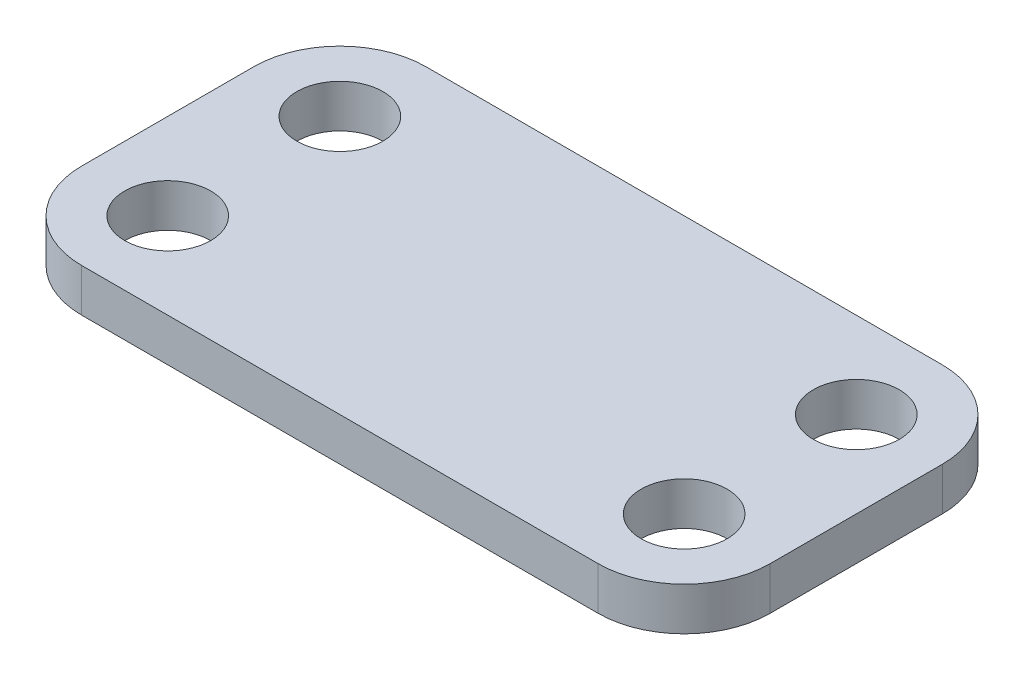
ISO-10303-21;
HEADER;
FILE_DESCRIPTION(('STEP AP214'),'2;1');
FILE_NAME('part.step','',(''),(''),'','','');
FILE_SCHEMA(('AUTOMOTIVE_DESIGN { 1 0 10303 214 1 1 1 1 }'));
ENDSEC;
DATA;
#1=APPLICATION_CONTEXT('core data for automotive mechanical design processes');
#2=APPLICATION_PROTOCOL_DEFINITION('international standard','automotive_design',2000,#1);
#3=PRODUCT_CONTEXT('',#1,'mechanical');
#4=PRODUCT('Part','Part','',(#3));
#5=PRODUCT_RELATED_PRODUCT_CATEGORY('part','',(#4));
#6=PRODUCT_DEFINITION_FORMATION('','',#4);
#7=PRODUCT_DEFINITION_CONTEXT('part definition',#1,'design');
#8=PRODUCT_DEFINITION('design','',#6,#7);
#9=PRODUCT_DEFINITION_SHAPE('','',#8);
#10=(LENGTH_UNIT() NAMED_UNIT(*) SI_UNIT(.MILLI.,.METRE.));
#11=(NAMED_UNIT(*) PLANE_ANGLE_UNIT() SI_UNIT($,.RADIAN.));
#12=(NAMED_UNIT(*) SI_UNIT($,.STERADIAN.) SOLID_ANGLE_UNIT());
#13=UNCERTAINTY_MEASURE_WITH_UNIT(LENGTH_MEASURE(1.E-05),#10,'distance_accuracy_value','');
#14=(GEOMETRIC_REPRESENTATION_CONTEXT(3) GLOBAL_UNCERTAINTY_ASSIGNED_CONTEXT((#13)) GLOBAL_UNIT_ASSIGNED_CONTEXT((#10,
#11,#12)) REPRESENTATION_CONTEXT('',''));
#15=CARTESIAN_POINT('',(0.,0.,0.));
#16=DIRECTION('',(0.,0.,1.));
#17=DIRECTION('',(1.,0.,0.));
#18=AXIS2_PLACEMENT_3D('',#15,#16,#17);
#19=CARTESIAN_POINT('',(-19.05,3.175,6.35));
#20=DIRECTION('',(0.,-1.,0.));
#21=DIRECTION('',(0.,0.,-1.));
#22=AXIS2_PLACEMENT_3D('',#19,#20,#21);
#23=PLANE('',#22);
#24=CARTESIAN_POINT('',(-19.05,3.175,6.35));
#25=DIRECTION('',(0.,1.,0.));
#26=DIRECTION('',(0.,0.,-1.));
#27=AXIS2_PLACEMENT_3D('',#24,#25,#26);
#28=CIRCLE('',#27,6.35);
#29=CARTESIAN_POINT('',(-25.4,3.175,6.35));
#30=VERTEX_POINT('',#29);
#31=CARTESIAN_POINT('',(-19.05,3.175,12.7));
#32=VERTEX_POINT('',#31);
#33=EDGE_CURVE('E172',#30,#32,#28,.T.);
#34=ORIENTED_EDGE('',*,*,#33,.T.);
#35=DIRECTION('',(1.,0.,0.));
#36=VECTOR('',#35,1.);
#37=CARTESIAN_POINT('',(-19.05,3.175,12.7));
#38=LINE('',#37,#36);
#39=CARTESIAN_POINT('',(19.05,3.175,12.7));
#40=VERTEX_POINT('',#39);
#41=EDGE_CURVE('E106',#32,#40,#38,.T.);
#42=ORIENTED_EDGE('',*,*,#41,.T.);
#43=CARTESIAN_POINT('',(19.05,3.175,6.35));
#44=DIRECTION('',(0.,1.,0.));
#45=DIRECTION('',(0.,0.,1.));
#46=AXIS2_PLACEMENT_3D('',#43,#44,#45);
#47=CIRCLE('',#46,6.35);
#48=CARTESIAN_POINT('',(25.4,3.175,6.35));
#49=VERTEX_POINT('',#48);
#50=EDGE_CURVE('E195',#40,#49,#47,.T.);
#51=ORIENTED_EDGE('',*,*,#50,.T.);
#52=DIRECTION('',(0.,0.,-1.));
#53=VECTOR('',#52,1.);
#54=CARTESIAN_POINT('',(25.4,3.175,6.35));
#55=LINE('',#54,#53);
#56=CARTESIAN_POINT('',(25.4,3.175,-6.35));
#57=VERTEX_POINT('',#56);
#58=EDGE_CURVE('E209',#49,#57,#55,.T.);
#59=ORIENTED_EDGE('',*,*,#58,.T.);
#60=CARTESIAN_POINT('',(19.05,3.175,-6.35));
#61=DIRECTION('',(0.,1.,0.));
#62=DIRECTION('',(0.,0.,1.));
#63=AXIS2_PLACEMENT_3D('',#60,#61,#62);
#64=CIRCLE('',#63,6.35);
#65=CARTESIAN_POINT('',(19.05,3.175,-12.7));
#66=VERTEX_POINT('',#65);
#67=EDGE_CURVE('E125',#57,#66,#64,.T.);
#68=ORIENTED_EDGE('',*,*,#67,.T.);
#69=DIRECTION('',(-1.,0.,0.));
#70=VECTOR('',#69,1.);
#71=CARTESIAN_POINT('',(-19.05,3.175,-12.7));
#72=LINE('',#71,#70);
#73=CARTESIAN_POINT('',(-19.05,3.175,-12.7));
#74=VERTEX_POINT('',#73);
#75=EDGE_CURVE('E119',#66,#74,#72,.T.);
#76=ORIENTED_EDGE('',*,*,#75,.T.);
#77=CARTESIAN_POINT('',(-19.05,3.175,-6.34999999999999));
#78=DIRECTION('',(0.,1.,0.));
#79=DIRECTION('',(0.,0.,-1.));
#80=AXIS2_PLACEMENT_3D('',#77,#78,#79);
#81=CIRCLE('',#80,6.35);
#82=CARTESIAN_POINT('',(-25.4,3.175,-6.34999999999999));
#83=VERTEX_POINT('',#82);
#84=EDGE_CURVE('E123',#74,#83,#81,.T.);
#85=ORIENTED_EDGE('',*,*,#84,.T.);
#86=DIRECTION('',(0.,0.,1.));
#87=VECTOR('',#86,1.);
#88=CARTESIAN_POINT('',(-25.4,3.175,6.35));
#89=LINE('',#88,#87);
#90=EDGE_CURVE('E63',#83,#30,#89,.T.);
#91=ORIENTED_EDGE('',*,*,#90,.T.);
#92=EDGE_LOOP('',(#34,#42,#51,#59,#68,#76,#85,#91));
#93=FACE_BOUND('',#92,.T.);
#94=CARTESIAN_POINT('',(-19.05,3.175,-6.34999999999999));
#95=DIRECTION('',(0.,1.,0.));
#96=DIRECTION('',(0.,0.,1.));
#97=AXIS2_PLACEMENT_3D('',#94,#95,#96);
#98=CIRCLE('',#97,3.175);
#99=CARTESIAN_POINT('',(-19.05,3.175,-3.17499999999999));
#100=VERTEX_POINT('',#99);
#101=EDGE_CURVE('E154',#100,#100,#98,.T.);
#102=ORIENTED_EDGE('',*,*,#101,.F.);
#103=EDGE_LOOP('',(#102));
#104=FACE_BOUND('',#103,.T.);
#105=CARTESIAN_POINT('',(-19.05,3.175,6.35));
#106=DIRECTION('',(0.,1.,0.));
#107=DIRECTION('',(0.,0.,1.));
#108=AXIS2_PLACEMENT_3D('',#105,#106,#107);
#109=CIRCLE('',#108,3.175);
#110=CARTESIAN_POINT('',(-19.05,3.175,9.525));
#111=VERTEX_POINT('',#110);
#112=EDGE_CURVE('E225',#111,#111,#109,.T.);
#113=ORIENTED_EDGE('',*,*,#112,.F.);
#114=EDGE_LOOP('',(#113));
#115=FACE_BOUND('',#114,.T.);
#116=CARTESIAN_POINT('',(19.05,3.175,-6.35));
#117=DIRECTION('',(0.,1.,0.));
#118=DIRECTION('',(0.,0.,1.));
#119=AXIS2_PLACEMENT_3D('',#116,#117,#118);
#120=CIRCLE('',#119,3.175);
#121=CARTESIAN_POINT('',(19.05,3.175,-3.175));
#122=VERTEX_POINT('',#121);
#123=EDGE_CURVE('E233',#122,#122,#120,.T.);
#124=ORIENTED_EDGE('',*,*,#123,.F.);
#125=EDGE_LOOP('',(#124));
#126=FACE_BOUND('',#125,.T.);
#127=CARTESIAN_POINT('',(19.05,3.175,6.35));
#128=DIRECTION('',(0.,1.,0.));
#129=DIRECTION('',(0.,0.,1.));
#130=AXIS2_PLACEMENT_3D('',#127,#128,#129);
#131=CIRCLE('',#130,3.175);
#132=CARTESIAN_POINT('',(19.05,3.175,9.52499999999999));
#133=VERTEX_POINT('',#132);
#134=EDGE_CURVE('E241',#133,#133,#131,.T.);
#135=ORIENTED_EDGE('',*,*,#134,.F.);
#136=EDGE_LOOP('',(#135));
#137=FACE_BOUND('',#136,.T.);
#138=ADVANCED_FACE('F45',(#93,#104,#115,#126,#137),#23,.F.);
#139=CARTESIAN_POINT('',(-19.05,0.,6.35));
#140=DIRECTION('',(0.,-1.,0.));
#141=DIRECTION('',(0.,0.,-1.));
#142=AXIS2_PLACEMENT_3D('',#139,#140,#141);
#143=PLANE('',#142);
#144=CARTESIAN_POINT('',(19.05,0.,-6.35));
#145=DIRECTION('',(0.,1.,0.));
#146=DIRECTION('',(0.,0.,1.));
#147=AXIS2_PLACEMENT_3D('',#144,#145,#146);
#148=CIRCLE('',#147,3.175);
#149=CARTESIAN_POINT('',(19.05,0.,-3.175));
#150=VERTEX_POINT('',#149);
#151=EDGE_CURVE('E237',#150,#150,#148,.T.);
#152=ORIENTED_EDGE('',*,*,#151,.T.);
#153=EDGE_LOOP('',(#152));
#154=FACE_BOUND('',#153,.T.);
#155=CARTESIAN_POINT('',(-19.05,0.,-6.34999999999999));
#156=DIRECTION('',(0.,1.,0.));
#157=DIRECTION('',(0.,0.,1.));
#158=AXIS2_PLACEMENT_3D('',#155,#156,#157);
#159=CIRCLE('',#158,3.175);
#160=CARTESIAN_POINT('',(-19.05,0.,-3.17499999999999));
#161=VERTEX_POINT('',#160);
#162=EDGE_CURVE('E221',#161,#161,#159,.T.);
#163=ORIENTED_EDGE('',*,*,#162,.T.);
#164=EDGE_LOOP('',(#163));
#165=FACE_BOUND('',#164,.T.);
#166=CARTESIAN_POINT('',(-19.05,0.,6.35));
#167=DIRECTION('',(0.,1.,0.));
#168=DIRECTION('',(0.,0.,-1.));
#169=AXIS2_PLACEMENT_3D('',#166,#167,#168);
#170=CIRCLE('',#169,6.35);
#171=CARTESIAN_POINT('',(-25.4,0.,6.35));
#172=VERTEX_POINT('',#171);
#173=CARTESIAN_POINT('',(-19.05,0.,12.7));
#174=VERTEX_POINT('',#173);
#175=EDGE_CURVE('E149',#172,#174,#170,.T.);
#176=ORIENTED_EDGE('',*,*,#175,.F.);
#177=DIRECTION('',(0.,0.,1.));
#178=VECTOR('',#177,1.);
#179=CARTESIAN_POINT('',(-25.4,0.,6.35));
#180=LINE('',#179,#178);
#181=CARTESIAN_POINT('',(-25.4,0.,-6.34999999999999));
#182=VERTEX_POINT('',#181);
#183=EDGE_CURVE('E98',#182,#172,#180,.T.);
#184=ORIENTED_EDGE('',*,*,#183,.F.);
#185=CARTESIAN_POINT('',(-19.05,0.,-6.34999999999999));
#186=DIRECTION('',(0.,1.,0.));
#187=DIRECTION('',(0.,0.,-1.));
#188=AXIS2_PLACEMENT_3D('',#185,#186,#187);
#189=CIRCLE('',#188,6.35);
#190=CARTESIAN_POINT('',(-19.05,0.,-12.7));
#191=VERTEX_POINT('',#190);
#192=EDGE_CURVE('E92',#191,#182,#189,.T.);
#193=ORIENTED_EDGE('',*,*,#192,.F.);
#194=DIRECTION('',(-1.,0.,0.));
#195=VECTOR('',#194,1.);
#196=CARTESIAN_POINT('',(-19.05,0.,-12.7));
#197=LINE('',#196,#195);
#198=CARTESIAN_POINT('',(19.05,0.,-12.7));
#199=VERTEX_POINT('',#198);
#200=EDGE_CURVE('E134',#199,#191,#197,.T.);
#201=ORIENTED_EDGE('',*,*,#200,.F.);
#202=CARTESIAN_POINT('',(19.05,0.,-6.35));
#203=DIRECTION('',(0.,1.,0.));
#204=DIRECTION('',(0.,0.,1.));
#205=AXIS2_PLACEMENT_3D('',#202,#203,#204);
#206=CIRCLE('',#205,6.35);
#207=CARTESIAN_POINT('',(25.4,0.,-6.35));
#208=VERTEX_POINT('',#207);
#209=EDGE_CURVE('E163',#208,#199,#206,.T.);
#210=ORIENTED_EDGE('',*,*,#209,.F.);
#211=DIRECTION('',(0.,0.,-1.));
#212=VECTOR('',#211,1.);
#213=CARTESIAN_POINT('',(25.4,0.,6.35));
#214=LINE('',#213,#212);
#215=CARTESIAN_POINT('',(25.4,0.,6.35));
#216=VERTEX_POINT('',#215);
#217=EDGE_CURVE('E160',#216,#208,#214,.T.);
#218=ORIENTED_EDGE('',*,*,#217,.F.);
#219=CARTESIAN_POINT('',(19.05,0.,6.35));
#220=DIRECTION('',(0.,1.,0.));
#221=DIRECTION('',(0.,0.,1.));
#222=AXIS2_PLACEMENT_3D('',#219,#220,#221);
#223=CIRCLE('',#222,6.35);
#224=CARTESIAN_POINT('',(19.05,0.,12.7));
#225=VERTEX_POINT('',#224);
#226=EDGE_CURVE('E157',#225,#216,#223,.T.);
#227=ORIENTED_EDGE('',*,*,#226,.F.);
#228=DIRECTION('',(1.,0.,0.));
#229=VECTOR('',#228,1.);
#230=CARTESIAN_POINT('',(-19.05,0.,12.7));
#231=LINE('',#230,#229);
#232=EDGE_CURVE('E153',#174,#225,#231,.T.);
#233=ORIENTED_EDGE('',*,*,#232,.F.);
#234=EDGE_LOOP('',(#176,#184,#193,#201,#210,#218,#227,#233));
#235=FACE_BOUND('',#234,.T.);
#236=CARTESIAN_POINT('',(-19.05,0.,6.35));
#237=DIRECTION('',(0.,1.,0.));
#238=DIRECTION('',(0.,0.,1.));
#239=AXIS2_PLACEMENT_3D('',#236,#237,#238);
#240=CIRCLE('',#239,3.175);
#241=CARTESIAN_POINT('',(-19.05,0.,9.525));
#242=VERTEX_POINT('',#241);
#243=EDGE_CURVE('E229',#242,#242,#240,.T.);
#244=ORIENTED_EDGE('',*,*,#243,.T.);
#245=EDGE_LOOP('',(#244));
#246=FACE_BOUND('',#245,.T.);
#247=CARTESIAN_POINT('',(19.05,0.,6.35));
#248=DIRECTION('',(0.,1.,0.));
#249=DIRECTION('',(0.,0.,1.));
#250=AXIS2_PLACEMENT_3D('',#247,#248,#249);
#251=CIRCLE('',#250,3.175);
#252=CARTESIAN_POINT('',(19.05,0.,9.52499999999999));
#253=VERTEX_POINT('',#252);
#254=EDGE_CURVE('E245',#253,#253,#251,.T.);
#255=ORIENTED_EDGE('',*,*,#254,.T.);
#256=EDGE_LOOP('',(#255));
#257=FACE_BOUND('',#256,.T.);
#258=ADVANCED_FACE('F199',(#154,#165,#235,#246,#257),#143,.T.);
#259=CARTESIAN_POINT('',(-19.05,3.175,6.35));
#260=DIRECTION('',(0.,-1.,0.));
#261=DIRECTION('',(0.,0.,-1.));
#262=AXIS2_PLACEMENT_3D('',#259,#260,#261);
#263=CYLINDRICAL_SURFACE('',#262,6.35);
#264=ORIENTED_EDGE('',*,*,#175,.T.);
#265=DIRECTION('',(0.,-1.,0.));
#266=VECTOR('',#265,1.);
#267=CARTESIAN_POINT('',(-19.05,3.175,12.7));
#268=LINE('',#267,#266);
#269=EDGE_CURVE('E11',#32,#174,#268,.T.);
#270=ORIENTED_EDGE('',*,*,#269,.F.);
#271=ORIENTED_EDGE('',*,*,#33,.F.);
#272=DIRECTION('',(0.,-1.,0.));
#273=VECTOR('',#272,1.);
#274=CARTESIAN_POINT('',(-25.4,3.175,6.35));
#275=LINE('',#274,#273);
#276=EDGE_CURVE('E145',#30,#172,#275,.T.);
#277=ORIENTED_EDGE('',*,*,#276,.T.);
#278=EDGE_LOOP('',(#264,#270,#271,#277));
#279=FACE_BOUND('',#278,.T.);
#280=ADVANCED_FACE('F47',(#279),#263,.T.);
#281=CARTESIAN_POINT('',(-19.05,3.175,12.7));
#282=DIRECTION('',(0.,0.,-1.));
#283=DIRECTION('',(-1.,0.,0.));
#284=AXIS2_PLACEMENT_3D('',#281,#282,#283);
#285=PLANE('',#284);
#286=ORIENTED_EDGE('',*,*,#232,.T.);
#287=DIRECTION('',(0.,-1.,0.));
#288=VECTOR('',#287,1.);
#289=CARTESIAN_POINT('',(19.05,3.175,12.7));
#290=LINE('',#289,#288);
#291=EDGE_CURVE('E55',#40,#225,#290,.T.);
#292=ORIENTED_EDGE('',*,*,#291,.F.);
#293=ORIENTED_EDGE('',*,*,#41,.F.);
#294=ORIENTED_EDGE('',*,*,#269,.T.);
#295=EDGE_LOOP('',(#286,#292,#293,#294));
#296=FACE_BOUND('',#295,.T.);
#297=ADVANCED_FACE('F281',(#296),#285,.F.);
#298=CARTESIAN_POINT('',(19.05,3.175,6.35));
#299=DIRECTION('',(0.,-1.,0.));
#300=DIRECTION('',(0.,0.,-1.));
#301=AXIS2_PLACEMENT_3D('',#298,#299,#300);
#302=CYLINDRICAL_SURFACE('',#301,6.35);
#303=ORIENTED_EDGE('',*,*,#226,.T.);
#304=DIRECTION('',(0.,-1.,0.));
#305=VECTOR('',#304,1.);
#306=CARTESIAN_POINT('',(25.4,3.175,6.35));
#307=LINE('',#306,#305);
#308=EDGE_CURVE('E183',#49,#216,#307,.T.);
#309=ORIENTED_EDGE('',*,*,#308,.F.);
#310=ORIENTED_EDGE('',*,*,#50,.F.);
#311=ORIENTED_EDGE('',*,*,#291,.T.);
#312=EDGE_LOOP('',(#303,#309,#310,#311));
#313=FACE_BOUND('',#312,.T.);
#314=ADVANCED_FACE('F193',(#313),#302,.T.);
#315=CARTESIAN_POINT('',(25.4,3.175,6.35));
#316=DIRECTION('',(-1.,0.,0.));
#317=DIRECTION('',(0.,0.,1.));
#318=AXIS2_PLACEMENT_3D('',#315,#316,#317);
#319=PLANE('',#318);
#320=ORIENTED_EDGE('',*,*,#217,.T.);
#321=DIRECTION('',(0.,-1.,0.));
#322=VECTOR('',#321,1.);
#323=CARTESIAN_POINT('',(25.4,3.175,-6.35));
#324=LINE('',#323,#322);
#325=EDGE_CURVE('E179',#57,#208,#324,.T.);
#326=ORIENTED_EDGE('',*,*,#325,.F.);
#327=ORIENTED_EDGE('',*,*,#58,.F.);
#328=ORIENTED_EDGE('',*,*,#308,.T.);
#329=EDGE_LOOP('',(#320,#326,#327,#328));
#330=FACE_BOUND('',#329,.T.);
#331=ADVANCED_FACE('F204',(#330),#319,.F.);
#332=CARTESIAN_POINT('',(19.05,3.175,-6.35));
#333=DIRECTION('',(0.,-1.,0.));
#334=DIRECTION('',(0.,0.,-1.));
#335=AXIS2_PLACEMENT_3D('',#332,#333,#334);
#336=CYLINDRICAL_SURFACE('',#335,6.35);
#337=ORIENTED_EDGE('',*,*,#209,.T.);
#338=DIRECTION('',(0.,-1.,0.));
#339=VECTOR('',#338,1.);
#340=CARTESIAN_POINT('',(19.05,3.175,-12.7));
#341=LINE('',#340,#339);
#342=EDGE_CURVE('E136',#66,#199,#341,.T.);
#343=ORIENTED_EDGE('',*,*,#342,.F.);
#344=ORIENTED_EDGE('',*,*,#67,.F.);
#345=ORIENTED_EDGE('',*,*,#325,.T.);
#346=EDGE_LOOP('',(#337,#343,#344,#345));
#347=FACE_BOUND('',#346,.T.);
#348=ADVANCED_FACE('F207',(#347),#336,.T.);
#349=CARTESIAN_POINT('',(-19.05,3.175,-12.7));
#350=DIRECTION('',(0.,0.,1.));
#351=DIRECTION('',(1.,0.,0.));
#352=AXIS2_PLACEMENT_3D('',#349,#350,#351);
#353=PLANE('',#352);
#354=ORIENTED_EDGE('',*,*,#200,.T.);
#355=DIRECTION('',(0.,-1.,0.));
#356=VECTOR('',#355,1.);
#357=CARTESIAN_POINT('',(-19.05,3.175,-12.7));
#358=LINE('',#357,#356);
#359=EDGE_CURVE('E131',#74,#191,#358,.T.);
#360=ORIENTED_EDGE('',*,*,#359,.F.);
#361=ORIENTED_EDGE('',*,*,#75,.F.);
#362=ORIENTED_EDGE('',*,*,#342,.T.);
#363=EDGE_LOOP('',(#354,#360,#361,#362));
#364=FACE_BOUND('',#363,.T.);
#365=ADVANCED_FACE('F132',(#364),#353,.F.);
#366=CARTESIAN_POINT('',(-19.05,3.175,-6.34999999999999));
#367=DIRECTION('',(0.,-1.,0.));
#368=DIRECTION('',(0.,0.,-1.));
#369=AXIS2_PLACEMENT_3D('',#366,#367,#368);
#370=CYLINDRICAL_SURFACE('',#369,6.35);
#371=ORIENTED_EDGE('',*,*,#192,.T.);
#372=DIRECTION('',(0.,-1.,0.));
#373=VECTOR('',#372,1.);
#374=CARTESIAN_POINT('',(-25.4,3.175,-6.34999999999999));
#375=LINE('',#374,#373);
#376=EDGE_CURVE('E137',#83,#182,#375,.T.);
#377=ORIENTED_EDGE('',*,*,#376,.F.);
#378=ORIENTED_EDGE('',*,*,#84,.F.);
#379=ORIENTED_EDGE('',*,*,#359,.T.);
#380=EDGE_LOOP('',(#371,#377,#378,#379));
#381=FACE_BOUND('',#380,.T.);
#382=ADVANCED_FACE('F139',(#381),#370,.T.);
#383=CARTESIAN_POINT('',(-25.4,3.175,6.35));
#384=DIRECTION('',(1.,0.,0.));
#385=DIRECTION('',(0.,0.,-1.));
#386=AXIS2_PLACEMENT_3D('',#383,#384,#385);
#387=PLANE('',#386);
#388=ORIENTED_EDGE('',*,*,#183,.T.);
#389=ORIENTED_EDGE('',*,*,#276,.F.);
#390=ORIENTED_EDGE('',*,*,#90,.F.);
#391=ORIENTED_EDGE('',*,*,#376,.T.);
#392=EDGE_LOOP('',(#388,#389,#390,#391));
#393=FACE_BOUND('',#392,.T.);
#394=ADVANCED_FACE('F269',(#393),#387,.F.);
#395=CARTESIAN_POINT('',(-19.05,3.175,-6.34999999999999));
#396=DIRECTION('',(0.,-1.,0.));
#397=DIRECTION('',(0.,0.,-1.));
#398=AXIS2_PLACEMENT_3D('',#395,#396,#397);
#399=CYLINDRICAL_SURFACE('',#398,3.175);
#400=ORIENTED_EDGE('',*,*,#101,.T.);
#401=EDGE_LOOP('',(#400));
#402=FACE_BOUND('',#401,.T.);
#403=ORIENTED_EDGE('',*,*,#162,.F.);
#404=EDGE_LOOP('',(#403));
#405=FACE_BOUND('',#404,.T.);
#406=ADVANCED_FACE('F266',(#402,#405),#399,.F.);
#407=CARTESIAN_POINT('',(-19.05,3.175,6.35));
#408=DIRECTION('',(0.,-1.,0.));
#409=DIRECTION('',(0.,0.,-1.));
#410=AXIS2_PLACEMENT_3D('',#407,#408,#409);
#411=CYLINDRICAL_SURFACE('',#410,3.175);
#412=ORIENTED_EDGE('',*,*,#112,.T.);
#413=EDGE_LOOP('',(#412));
#414=FACE_BOUND('',#413,.T.);
#415=ORIENTED_EDGE('',*,*,#243,.F.);
#416=EDGE_LOOP('',(#415));
#417=FACE_BOUND('',#416,.T.);
#418=ADVANCED_FACE('F357',(#414,#417),#411,.F.);
#419=CARTESIAN_POINT('',(19.05,3.175,-6.35));
#420=DIRECTION('',(0.,-1.,0.));
#421=DIRECTION('',(0.,0.,-1.));
#422=AXIS2_PLACEMENT_3D('',#419,#420,#421);
#423=CYLINDRICAL_SURFACE('',#422,3.175);
#424=ORIENTED_EDGE('',*,*,#123,.T.);
#425=EDGE_LOOP('',(#424));
#426=FACE_BOUND('',#425,.T.);
#427=ORIENTED_EDGE('',*,*,#151,.F.);
#428=EDGE_LOOP('',(#427));
#429=FACE_BOUND('',#428,.T.);
#430=ADVANCED_FACE('F366',(#426,#429),#423,.F.);
#431=CARTESIAN_POINT('',(19.05,3.175,6.35));
#432=DIRECTION('',(0.,-1.,0.));
#433=DIRECTION('',(0.,0.,-1.));
#434=AXIS2_PLACEMENT_3D('',#431,#432,#433);
#435=CYLINDRICAL_SURFACE('',#434,3.175);
#436=ORIENTED_EDGE('',*,*,#134,.T.);
#437=EDGE_LOOP('',(#436));
#438=FACE_BOUND('',#437,.T.);
#439=ORIENTED_EDGE('',*,*,#254,.F.);
#440=EDGE_LOOP('',(#439));
#441=FACE_BOUND('',#440,.T.);
#442=ADVANCED_FACE('F255',(#438,#441),#435,.F.);
#443=CLOSED_SHELL('',(#138,#258,#280,#297,#314,#331,#348,#365,#382,#394,#406,#418,#430,#442));
#444=MANIFOLD_SOLID_BREP('B2',#443);
#445=ADVANCED_BREP_SHAPE_REPRESENTATION('',(#18,#444),#14);
#446=SHAPE_DEFINITION_REPRESENTATION(#9,#445);
ENDSEC;
END-ISO-10303-21;
